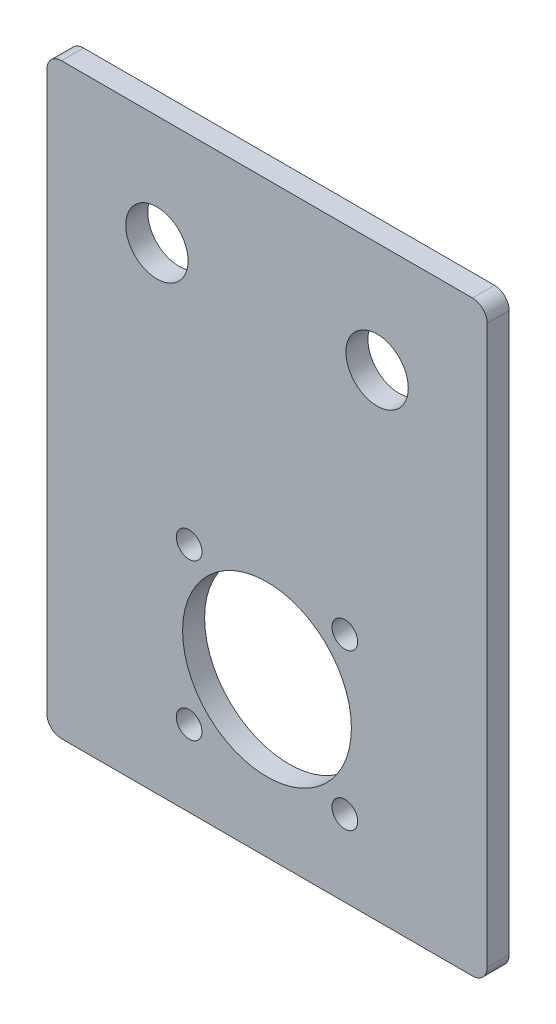
ISO-10303-21;
HEADER;
FILE_DESCRIPTION(('STEP AP214'),'2;1');
FILE_NAME('part.step','',(''),(''),'','','');
FILE_SCHEMA(('AUTOMOTIVE_DESIGN { 1 0 10303 214 1 1 1 1 }'));
ENDSEC;
DATA;
#1=APPLICATION_CONTEXT('core data for automotive mechanical design processes');
#2=APPLICATION_PROTOCOL_DEFINITION('international standard','automotive_design',2000,#1);
#3=PRODUCT_CONTEXT('',#1,'mechanical');
#4=PRODUCT('Part','Part','',(#3));
#5=PRODUCT_RELATED_PRODUCT_CATEGORY('part','',(#4));
#6=PRODUCT_DEFINITION_FORMATION('','',#4);
#7=PRODUCT_DEFINITION_CONTEXT('part definition',#1,'design');
#8=PRODUCT_DEFINITION('design','',#6,#7);
#9=PRODUCT_DEFINITION_SHAPE('','',#8);
#10=(LENGTH_UNIT() NAMED_UNIT(*) SI_UNIT(.MILLI.,.METRE.));
#11=(NAMED_UNIT(*) PLANE_ANGLE_UNIT() SI_UNIT($,.RADIAN.));
#12=(NAMED_UNIT(*) SI_UNIT($,.STERADIAN.) SOLID_ANGLE_UNIT());
#13=UNCERTAINTY_MEASURE_WITH_UNIT(LENGTH_MEASURE(1.E-05),#10,'distance_accuracy_value','');
#14=(GEOMETRIC_REPRESENTATION_CONTEXT(3) GLOBAL_UNCERTAINTY_ASSIGNED_CONTEXT((#13)) GLOBAL_UNIT_ASSIGNED_CONTEXT((#10,
#11,#12)) REPRESENTATION_CONTEXT('',''));
#15=CARTESIAN_POINT('',(0.,0.,0.));
#16=DIRECTION('',(0.,0.,1.));
#17=DIRECTION('',(1.,0.,0.));
#18=AXIS2_PLACEMENT_3D('',#15,#16,#17);
#19=CARTESIAN_POINT('',(0.,0.,3.));
#20=DIRECTION('',(1.,0.,0.));
#21=DIRECTION('',(0.,0.,-1.));
#22=AXIS2_PLACEMENT_3D('',#19,#20,#21);
#23=PLANE('',#22);
#24=DIRECTION('',(0.,-1.,0.));
#25=VECTOR('',#24,1.);
#26=CARTESIAN_POINT('',(0.,0.,3.));
#27=LINE('',#26,#25);
#28=CARTESIAN_POINT('',(0.,78.,3.));
#29=VERTEX_POINT('',#28);
#30=CARTESIAN_POINT('',(0.,2.,3.));
#31=VERTEX_POINT('',#30);
#32=EDGE_CURVE('E120',#29,#31,#27,.T.);
#33=ORIENTED_EDGE('',*,*,#32,.F.);
#34=DIRECTION('',(0.,0.,-1.));
#35=VECTOR('',#34,1.);
#36=CARTESIAN_POINT('',(0.,78.,3.));
#37=LINE('',#36,#35);
#38=CARTESIAN_POINT('',(0.,78.,0.));
#39=VERTEX_POINT('',#38);
#40=EDGE_CURVE('E105',#29,#39,#37,.T.);
#41=ORIENTED_EDGE('',*,*,#40,.T.);
#42=DIRECTION('',(0.,-1.,0.));
#43=VECTOR('',#42,1.);
#44=CARTESIAN_POINT('',(0.,0.,0.));
#45=LINE('',#44,#43);
#46=CARTESIAN_POINT('',(0.,2.,0.));
#47=VERTEX_POINT('',#46);
#48=EDGE_CURVE('E117',#39,#47,#45,.T.);
#49=ORIENTED_EDGE('',*,*,#48,.T.);
#50=DIRECTION('',(0.,0.,-1.));
#51=VECTOR('',#50,1.);
#52=CARTESIAN_POINT('',(0.,2.,3.));
#53=LINE('',#52,#51);
#54=EDGE_CURVE('E122',#47,#31,#53,.F.);
#55=ORIENTED_EDGE('',*,*,#54,.T.);
#56=EDGE_LOOP('',(#33,#41,#49,#55));
#57=FACE_BOUND('',#56,.T.);
#58=ADVANCED_FACE('F35',(#57),#23,.F.);
#59=CARTESIAN_POINT('',(0.,0.,3.));
#60=DIRECTION('',(0.,1.,0.));
#61=DIRECTION('',(0.,0.,1.));
#62=AXIS2_PLACEMENT_3D('',#59,#60,#61);
#63=PLANE('',#62);
#64=DIRECTION('',(1.,0.,0.));
#65=VECTOR('',#64,1.);
#66=CARTESIAN_POINT('',(0.,0.,0.));
#67=LINE('',#66,#65);
#68=CARTESIAN_POINT('',(2.,0.,0.));
#69=VERTEX_POINT('',#68);
#70=CARTESIAN_POINT('',(58.,0.,0.));
#71=VERTEX_POINT('',#70);
#72=EDGE_CURVE('E126',#69,#71,#67,.T.);
#73=ORIENTED_EDGE('',*,*,#72,.T.);
#74=DIRECTION('',(0.,0.,-1.));
#75=VECTOR('',#74,1.);
#76=CARTESIAN_POINT('',(58.,0.,3.));
#77=LINE('',#76,#75);
#78=CARTESIAN_POINT('',(58.,0.,3.));
#79=VERTEX_POINT('',#78);
#80=EDGE_CURVE('E11',#71,#79,#77,.F.);
#81=ORIENTED_EDGE('',*,*,#80,.T.);
#82=DIRECTION('',(1.,0.,0.));
#83=VECTOR('',#82,1.);
#84=CARTESIAN_POINT('',(0.,0.,3.));
#85=LINE('',#84,#83);
#86=CARTESIAN_POINT('',(2.,0.,3.));
#87=VERTEX_POINT('',#86);
#88=EDGE_CURVE('E166',#87,#79,#85,.T.);
#89=ORIENTED_EDGE('',*,*,#88,.F.);
#90=DIRECTION('',(0.,0.,-1.));
#91=VECTOR('',#90,1.);
#92=CARTESIAN_POINT('',(2.,0.,3.));
#93=LINE('',#92,#91);
#94=EDGE_CURVE('E43',#87,#69,#93,.T.);
#95=ORIENTED_EDGE('',*,*,#94,.T.);
#96=EDGE_LOOP('',(#73,#81,#89,#95));
#97=FACE_BOUND('',#96,.T.);
#98=ADVANCED_FACE('F164',(#97),#63,.F.);
#99=CARTESIAN_POINT('',(60.,0.,3.));
#100=DIRECTION('',(-1.,0.,0.));
#101=DIRECTION('',(0.,0.,1.));
#102=AXIS2_PLACEMENT_3D('',#99,#100,#101);
#103=PLANE('',#102);
#104=DIRECTION('',(0.,1.,0.));
#105=VECTOR('',#104,1.);
#106=CARTESIAN_POINT('',(60.,0.,0.));
#107=LINE('',#106,#105);
#108=CARTESIAN_POINT('',(60.,2.,0.));
#109=VERTEX_POINT('',#108);
#110=CARTESIAN_POINT('',(60.,78.,0.));
#111=VERTEX_POINT('',#110);
#112=EDGE_CURVE('E130',#109,#111,#107,.T.);
#113=ORIENTED_EDGE('',*,*,#112,.T.);
#114=DIRECTION('',(0.,0.,-1.));
#115=VECTOR('',#114,1.);
#116=CARTESIAN_POINT('',(60.,78.,3.));
#117=LINE('',#116,#115);
#118=CARTESIAN_POINT('',(60.,78.,3.));
#119=VERTEX_POINT('',#118);
#120=EDGE_CURVE('E50',#111,#119,#117,.F.);
#121=ORIENTED_EDGE('',*,*,#120,.T.);
#122=DIRECTION('',(0.,1.,0.));
#123=VECTOR('',#122,1.);
#124=CARTESIAN_POINT('',(60.,0.,3.));
#125=LINE('',#124,#123);
#126=CARTESIAN_POINT('',(60.,2.,3.));
#127=VERTEX_POINT('',#126);
#128=EDGE_CURVE('E174',#127,#119,#125,.T.);
#129=ORIENTED_EDGE('',*,*,#128,.F.);
#130=DIRECTION('',(0.,0.,-1.));
#131=VECTOR('',#130,1.);
#132=CARTESIAN_POINT('',(60.,2.,3.));
#133=LINE('',#132,#131);
#134=EDGE_CURVE('E157',#127,#109,#133,.T.);
#135=ORIENTED_EDGE('',*,*,#134,.T.);
#136=EDGE_LOOP('',(#113,#121,#129,#135));
#137=FACE_BOUND('',#136,.T.);
#138=ADVANCED_FACE('F173',(#137),#103,.F.);
#139=CARTESIAN_POINT('',(0.,80.,3.));
#140=DIRECTION('',(0.,-1.,0.));
#141=DIRECTION('',(0.,0.,-1.));
#142=AXIS2_PLACEMENT_3D('',#139,#140,#141);
#143=PLANE('',#142);
#144=DIRECTION('',(-1.,0.,0.));
#145=VECTOR('',#144,1.);
#146=CARTESIAN_POINT('',(0.,80.,0.));
#147=LINE('',#146,#145);
#148=CARTESIAN_POINT('',(58.,80.,0.));
#149=VERTEX_POINT('',#148);
#150=CARTESIAN_POINT('',(2.,80.,0.));
#151=VERTEX_POINT('',#150);
#152=EDGE_CURVE('E140',#149,#151,#147,.T.);
#153=ORIENTED_EDGE('',*,*,#152,.T.);
#154=DIRECTION('',(0.,0.,-1.));
#155=VECTOR('',#154,1.);
#156=CARTESIAN_POINT('',(2.,80.,3.));
#157=LINE('',#156,#155);
#158=CARTESIAN_POINT('',(2.,80.,3.));
#159=VERTEX_POINT('',#158);
#160=EDGE_CURVE('E106',#151,#159,#157,.F.);
#161=ORIENTED_EDGE('',*,*,#160,.T.);
#162=DIRECTION('',(-1.,0.,0.));
#163=VECTOR('',#162,1.);
#164=CARTESIAN_POINT('',(0.,80.,3.));
#165=LINE('',#164,#163);
#166=CARTESIAN_POINT('',(58.,80.,3.));
#167=VERTEX_POINT('',#166);
#168=EDGE_CURVE('E136',#167,#159,#165,.T.);
#169=ORIENTED_EDGE('',*,*,#168,.F.);
#170=DIRECTION('',(0.,0.,-1.));
#171=VECTOR('',#170,1.);
#172=CARTESIAN_POINT('',(58.,80.,3.));
#173=LINE('',#172,#171);
#174=EDGE_CURVE('E111',#167,#149,#173,.T.);
#175=ORIENTED_EDGE('',*,*,#174,.T.);
#176=EDGE_LOOP('',(#153,#161,#169,#175));
#177=FACE_BOUND('',#176,.T.);
#178=ADVANCED_FACE('F232',(#177),#143,.F.);
#179=CARTESIAN_POINT('',(0.,0.,3.));
#180=DIRECTION('',(0.,0.,-1.));
#181=DIRECTION('',(-1.,0.,0.));
#182=AXIS2_PLACEMENT_3D('',#179,#180,#181);
#183=PLANE('',#182);
#184=CARTESIAN_POINT('',(40.6066017177989,10.3933982822025,3.));
#185=DIRECTION('',(0.,0.,1.));
#186=DIRECTION('',(1.,0.,0.));
#187=AXIS2_PLACEMENT_3D('',#184,#185,#186);
#188=CIRCLE('',#187,1.75);
#189=CARTESIAN_POINT('',(42.3566017177989,10.3933982822025,3.));
#190=VERTEX_POINT('',#189);
#191=EDGE_CURVE('E201',#190,#190,#188,.T.);
#192=ORIENTED_EDGE('',*,*,#191,.F.);
#193=EDGE_LOOP('',(#192));
#194=FACE_BOUND('',#193,.T.);
#195=CARTESIAN_POINT('',(19.3933982822025,10.3933982822018,3.));
#196=DIRECTION('',(0.,0.,1.));
#197=DIRECTION('',(1.,0.,0.));
#198=AXIS2_PLACEMENT_3D('',#195,#196,#197);
#199=CIRCLE('',#198,1.75);
#200=CARTESIAN_POINT('',(21.1433982822025,10.3933982822018,3.));
#201=VERTEX_POINT('',#200);
#202=EDGE_CURVE('E213',#201,#201,#199,.T.);
#203=ORIENTED_EDGE('',*,*,#202,.F.);
#204=EDGE_LOOP('',(#203));
#205=FACE_BOUND('',#204,.T.);
#206=CARTESIAN_POINT('',(45.,65.,3.));
#207=DIRECTION('',(0.,0.,1.));
#208=DIRECTION('',(1.,0.,0.));
#209=AXIS2_PLACEMENT_3D('',#206,#207,#208);
#210=CIRCLE('',#209,4.25000000000001);
#211=CARTESIAN_POINT('',(49.25,65.,3.));
#212=VERTEX_POINT('',#211);
#213=EDGE_CURVE('E207',#212,#212,#210,.T.);
#214=ORIENTED_EDGE('',*,*,#213,.F.);
#215=EDGE_LOOP('',(#214));
#216=FACE_BOUND('',#215,.T.);
#217=CARTESIAN_POINT('',(19.3933982822018,31.6066017177982,3.));
#218=DIRECTION('',(0.,0.,1.));
#219=DIRECTION('',(1.,0.,0.));
#220=AXIS2_PLACEMENT_3D('',#217,#218,#219);
#221=CIRCLE('',#220,1.75);
#222=CARTESIAN_POINT('',(21.1433982822018,31.6066017177982,3.));
#223=VERTEX_POINT('',#222);
#224=EDGE_CURVE('E183',#223,#223,#221,.T.);
#225=ORIENTED_EDGE('',*,*,#224,.F.);
#226=EDGE_LOOP('',(#225));
#227=FACE_BOUND('',#226,.T.);
#228=CARTESIAN_POINT('',(15.,65.,3.));
#229=DIRECTION('',(0.,0.,1.));
#230=DIRECTION('',(1.,0.,0.));
#231=AXIS2_PLACEMENT_3D('',#228,#229,#230);
#232=CIRCLE('',#231,4.25);
#233=CARTESIAN_POINT('',(19.25,65.,3.));
#234=VERTEX_POINT('',#233);
#235=EDGE_CURVE('E196',#234,#234,#232,.T.);
#236=ORIENTED_EDGE('',*,*,#235,.F.);
#237=EDGE_LOOP('',(#236));
#238=FACE_BOUND('',#237,.T.);
#239=CARTESIAN_POINT('',(40.6066017177982,31.6066017177989,3.));
#240=DIRECTION('',(0.,0.,1.));
#241=DIRECTION('',(1.,0.,0.));
#242=AXIS2_PLACEMENT_3D('',#239,#240,#241);
#243=CIRCLE('',#242,1.75);
#244=CARTESIAN_POINT('',(42.3566017177982,31.6066017177989,3.));
#245=VERTEX_POINT('',#244);
#246=EDGE_CURVE('E189',#245,#245,#243,.T.);
#247=ORIENTED_EDGE('',*,*,#246,.F.);
#248=EDGE_LOOP('',(#247));
#249=FACE_BOUND('',#248,.T.);
#250=CARTESIAN_POINT('',(30.,21.,3.));
#251=DIRECTION('',(0.,0.,1.));
#252=DIRECTION('',(1.,0.,0.));
#253=AXIS2_PLACEMENT_3D('',#250,#251,#252);
#254=CIRCLE('',#253,11.5);
#255=CARTESIAN_POINT('',(41.5,21.,3.));
#256=VERTEX_POINT('',#255);
#257=EDGE_CURVE('E133',#256,#256,#254,.T.);
#258=ORIENTED_EDGE('',*,*,#257,.F.);
#259=EDGE_LOOP('',(#258));
#260=FACE_BOUND('',#259,.T.);
#261=ORIENTED_EDGE('',*,*,#168,.T.);
#262=CARTESIAN_POINT('',(2.,78.,3.));
#263=DIRECTION('',(0.,0.,-1.));
#264=DIRECTION('',(-1.,0.,0.));
#265=AXIS2_PLACEMENT_3D('',#262,#263,#264);
#266=CIRCLE('',#265,2.);
#267=EDGE_CURVE('E155',#159,#29,#266,.F.);
#268=ORIENTED_EDGE('',*,*,#267,.T.);
#269=ORIENTED_EDGE('',*,*,#32,.T.);
#270=CARTESIAN_POINT('',(2.,2.,3.));
#271=DIRECTION('',(0.,0.,-1.));
#272=DIRECTION('',(-1.,0.,0.));
#273=AXIS2_PLACEMENT_3D('',#270,#271,#272);
#274=CIRCLE('',#273,2.);
#275=EDGE_CURVE('E150',#31,#87,#274,.F.);
#276=ORIENTED_EDGE('',*,*,#275,.T.);
#277=ORIENTED_EDGE('',*,*,#88,.T.);
#278=CARTESIAN_POINT('',(58.,2.,3.));
#279=DIRECTION('',(0.,0.,-1.));
#280=DIRECTION('',(-1.,0.,0.));
#281=AXIS2_PLACEMENT_3D('',#278,#279,#280);
#282=CIRCLE('',#281,2.);
#283=EDGE_CURVE('E57',#79,#127,#282,.F.);
#284=ORIENTED_EDGE('',*,*,#283,.T.);
#285=ORIENTED_EDGE('',*,*,#128,.T.);
#286=CARTESIAN_POINT('',(58.,78.,3.));
#287=DIRECTION('',(0.,0.,-1.));
#288=DIRECTION('',(-1.,0.,0.));
#289=AXIS2_PLACEMENT_3D('',#286,#287,#288);
#290=CIRCLE('',#289,2.);
#291=EDGE_CURVE('E153',#119,#167,#290,.F.);
#292=ORIENTED_EDGE('',*,*,#291,.T.);
#293=EDGE_LOOP('',(#261,#268,#269,#276,#277,#284,#285,#292));
#294=FACE_BOUND('',#293,.T.);
#295=ADVANCED_FACE('F229',(#194,#205,#216,#227,#238,#249,#260,#294),#183,.F.);
#296=CARTESIAN_POINT('',(0.,0.,0.));
#297=DIRECTION('',(0.,0.,-1.));
#298=DIRECTION('',(-1.,0.,0.));
#299=AXIS2_PLACEMENT_3D('',#296,#297,#298);
#300=PLANE('',#299);
#301=CARTESIAN_POINT('',(40.6066017177989,10.3933982822025,0.));
#302=DIRECTION('',(0.,0.,1.));
#303=DIRECTION('',(1.,0.,0.));
#304=AXIS2_PLACEMENT_3D('',#301,#302,#303);
#305=CIRCLE('',#304,1.75);
#306=CARTESIAN_POINT('',(42.3566017177989,10.3933982822025,0.));
#307=VERTEX_POINT('',#306);
#308=EDGE_CURVE('E193',#307,#307,#305,.T.);
#309=ORIENTED_EDGE('',*,*,#308,.T.);
#310=EDGE_LOOP('',(#309));
#311=FACE_BOUND('',#310,.T.);
#312=CARTESIAN_POINT('',(19.3933982822025,10.3933982822018,0.));
#313=DIRECTION('',(0.,0.,1.));
#314=DIRECTION('',(1.,0.,0.));
#315=AXIS2_PLACEMENT_3D('',#312,#313,#314);
#316=CIRCLE('',#315,1.75);
#317=CARTESIAN_POINT('',(21.1433982822025,10.3933982822018,0.));
#318=VERTEX_POINT('',#317);
#319=EDGE_CURVE('E204',#318,#318,#316,.T.);
#320=ORIENTED_EDGE('',*,*,#319,.T.);
#321=EDGE_LOOP('',(#320));
#322=FACE_BOUND('',#321,.T.);
#323=CARTESIAN_POINT('',(45.,65.,0.));
#324=DIRECTION('',(0.,0.,1.));
#325=DIRECTION('',(1.,0.,0.));
#326=AXIS2_PLACEMENT_3D('',#323,#324,#325);
#327=CIRCLE('',#326,4.25000000000001);
#328=CARTESIAN_POINT('',(49.25,65.,0.));
#329=VERTEX_POINT('',#328);
#330=EDGE_CURVE('E210',#329,#329,#327,.T.);
#331=ORIENTED_EDGE('',*,*,#330,.T.);
#332=EDGE_LOOP('',(#331));
#333=FACE_BOUND('',#332,.T.);
#334=CARTESIAN_POINT('',(19.3933982822018,31.6066017177982,0.));
#335=DIRECTION('',(0.,0.,1.));
#336=DIRECTION('',(1.,0.,0.));
#337=AXIS2_PLACEMENT_3D('',#334,#335,#336);
#338=CIRCLE('',#337,1.75);
#339=CARTESIAN_POINT('',(21.1433982822018,31.6066017177982,0.));
#340=VERTEX_POINT('',#339);
#341=EDGE_CURVE('E181',#340,#340,#338,.T.);
#342=ORIENTED_EDGE('',*,*,#341,.T.);
#343=EDGE_LOOP('',(#342));
#344=FACE_BOUND('',#343,.T.);
#345=CARTESIAN_POINT('',(15.,65.,0.));
#346=DIRECTION('',(0.,0.,1.));
#347=DIRECTION('',(1.,0.,0.));
#348=AXIS2_PLACEMENT_3D('',#345,#346,#347);
#349=CIRCLE('',#348,4.25);
#350=CARTESIAN_POINT('',(19.25,65.,0.));
#351=VERTEX_POINT('',#350);
#352=EDGE_CURVE('E186',#351,#351,#349,.T.);
#353=ORIENTED_EDGE('',*,*,#352,.T.);
#354=EDGE_LOOP('',(#353));
#355=FACE_BOUND('',#354,.T.);
#356=CARTESIAN_POINT('',(40.6066017177982,31.6066017177989,0.));
#357=DIRECTION('',(0.,0.,1.));
#358=DIRECTION('',(1.,0.,0.));
#359=AXIS2_PLACEMENT_3D('',#356,#357,#358);
#360=CIRCLE('',#359,1.75);
#361=CARTESIAN_POINT('',(42.3566017177982,31.6066017177989,0.));
#362=VERTEX_POINT('',#361);
#363=EDGE_CURVE('E192',#362,#362,#360,.T.);
#364=ORIENTED_EDGE('',*,*,#363,.T.);
#365=EDGE_LOOP('',(#364));
#366=FACE_BOUND('',#365,.T.);
#367=CARTESIAN_POINT('',(30.,21.,0.));
#368=DIRECTION('',(0.,0.,1.));
#369=DIRECTION('',(1.,0.,0.));
#370=AXIS2_PLACEMENT_3D('',#367,#368,#369);
#371=CIRCLE('',#370,11.5);
#372=CARTESIAN_POINT('',(41.5,21.,0.));
#373=VERTEX_POINT('',#372);
#374=EDGE_CURVE('E127',#373,#373,#371,.T.);
#375=ORIENTED_EDGE('',*,*,#374,.T.);
#376=EDGE_LOOP('',(#375));
#377=FACE_BOUND('',#376,.T.);
#378=ORIENTED_EDGE('',*,*,#48,.F.);
#379=CARTESIAN_POINT('',(2.,78.,0.));
#380=DIRECTION('',(0.,0.,-1.));
#381=DIRECTION('',(-1.,0.,0.));
#382=AXIS2_PLACEMENT_3D('',#379,#380,#381);
#383=CIRCLE('',#382,2.);
#384=EDGE_CURVE('E101',#39,#151,#383,.T.);
#385=ORIENTED_EDGE('',*,*,#384,.T.);
#386=ORIENTED_EDGE('',*,*,#152,.F.);
#387=CARTESIAN_POINT('',(58.,78.,0.));
#388=DIRECTION('',(0.,0.,-1.));
#389=DIRECTION('',(-1.,0.,0.));
#390=AXIS2_PLACEMENT_3D('',#387,#388,#389);
#391=CIRCLE('',#390,2.);
#392=EDGE_CURVE('E112',#149,#111,#391,.T.);
#393=ORIENTED_EDGE('',*,*,#392,.T.);
#394=ORIENTED_EDGE('',*,*,#112,.F.);
#395=CARTESIAN_POINT('',(58.,2.,0.));
#396=DIRECTION('',(0.,0.,-1.));
#397=DIRECTION('',(-1.,0.,0.));
#398=AXIS2_PLACEMENT_3D('',#395,#396,#397);
#399=CIRCLE('',#398,2.);
#400=EDGE_CURVE('E144',#109,#71,#399,.T.);
#401=ORIENTED_EDGE('',*,*,#400,.T.);
#402=ORIENTED_EDGE('',*,*,#72,.F.);
#403=CARTESIAN_POINT('',(2.,2.,0.));
#404=DIRECTION('',(0.,0.,-1.));
#405=DIRECTION('',(-1.,0.,0.));
#406=AXIS2_PLACEMENT_3D('',#403,#404,#405);
#407=CIRCLE('',#406,2.);
#408=EDGE_CURVE('E121',#69,#47,#407,.T.);
#409=ORIENTED_EDGE('',*,*,#408,.T.);
#410=EDGE_LOOP('',(#378,#385,#386,#393,#394,#401,#402,#409));
#411=FACE_BOUND('',#410,.T.);
#412=ADVANCED_FACE('F124',(#311,#322,#333,#344,#355,#366,#377,#411),#300,.T.);
#413=CARTESIAN_POINT('',(30.,21.,0.));
#414=DIRECTION('',(0.,0.,1.));
#415=DIRECTION('',(1.,0.,0.));
#416=AXIS2_PLACEMENT_3D('',#413,#414,#415);
#417=CYLINDRICAL_SURFACE('',#416,11.5);
#418=ORIENTED_EDGE('',*,*,#374,.F.);
#419=EDGE_LOOP('',(#418));
#420=FACE_BOUND('',#419,.T.);
#421=ORIENTED_EDGE('',*,*,#257,.T.);
#422=EDGE_LOOP('',(#421));
#423=FACE_BOUND('',#422,.T.);
#424=ADVANCED_FACE('F268',(#420,#423),#417,.F.);
#425=CARTESIAN_POINT('',(40.6066017177982,31.6066017177989,0.));
#426=DIRECTION('',(0.,0.,1.));
#427=DIRECTION('',(1.,0.,0.));
#428=AXIS2_PLACEMENT_3D('',#425,#426,#427);
#429=CYLINDRICAL_SURFACE('',#428,1.75);
#430=ORIENTED_EDGE('',*,*,#363,.F.);
#431=EDGE_LOOP('',(#430));
#432=FACE_BOUND('',#431,.T.);
#433=ORIENTED_EDGE('',*,*,#246,.T.);
#434=EDGE_LOOP('',(#433));
#435=FACE_BOUND('',#434,.T.);
#436=ADVANCED_FACE('F273',(#432,#435),#429,.F.);
#437=CARTESIAN_POINT('',(15.,65.,0.));
#438=DIRECTION('',(0.,0.,1.));
#439=DIRECTION('',(1.,0.,0.));
#440=AXIS2_PLACEMENT_3D('',#437,#438,#439);
#441=CYLINDRICAL_SURFACE('',#440,4.25);
#442=ORIENTED_EDGE('',*,*,#352,.F.);
#443=EDGE_LOOP('',(#442));
#444=FACE_BOUND('',#443,.T.);
#445=ORIENTED_EDGE('',*,*,#235,.T.);
#446=EDGE_LOOP('',(#445));
#447=FACE_BOUND('',#446,.T.);
#448=ADVANCED_FACE('F278',(#444,#447),#441,.F.);
#449=CARTESIAN_POINT('',(19.3933982822018,31.6066017177982,0.));
#450=DIRECTION('',(0.,0.,1.));
#451=DIRECTION('',(1.,0.,0.));
#452=AXIS2_PLACEMENT_3D('',#449,#450,#451);
#453=CYLINDRICAL_SURFACE('',#452,1.75);
#454=ORIENTED_EDGE('',*,*,#341,.F.);
#455=EDGE_LOOP('',(#454));
#456=FACE_BOUND('',#455,.T.);
#457=ORIENTED_EDGE('',*,*,#224,.T.);
#458=EDGE_LOOP('',(#457));
#459=FACE_BOUND('',#458,.T.);
#460=ADVANCED_FACE('F275',(#456,#459),#453,.F.);
#461=CARTESIAN_POINT('',(45.,65.,0.));
#462=DIRECTION('',(0.,0.,1.));
#463=DIRECTION('',(1.,0.,0.));
#464=AXIS2_PLACEMENT_3D('',#461,#462,#463);
#465=CYLINDRICAL_SURFACE('',#464,4.25000000000001);
#466=ORIENTED_EDGE('',*,*,#330,.F.);
#467=EDGE_LOOP('',(#466));
#468=FACE_BOUND('',#467,.T.);
#469=ORIENTED_EDGE('',*,*,#213,.T.);
#470=EDGE_LOOP('',(#469));
#471=FACE_BOUND('',#470,.T.);
#472=ADVANCED_FACE('F225',(#468,#471),#465,.F.);
#473=CARTESIAN_POINT('',(19.3933982822025,10.3933982822018,0.));
#474=DIRECTION('',(0.,0.,1.));
#475=DIRECTION('',(1.,0.,0.));
#476=AXIS2_PLACEMENT_3D('',#473,#474,#475);
#477=CYLINDRICAL_SURFACE('',#476,1.75);
#478=ORIENTED_EDGE('',*,*,#319,.F.);
#479=EDGE_LOOP('',(#478));
#480=FACE_BOUND('',#479,.T.);
#481=ORIENTED_EDGE('',*,*,#202,.T.);
#482=EDGE_LOOP('',(#481));
#483=FACE_BOUND('',#482,.T.);
#484=ADVANCED_FACE('F221',(#480,#483),#477,.F.);
#485=CARTESIAN_POINT('',(40.6066017177989,10.3933982822025,0.));
#486=DIRECTION('',(0.,0.,1.));
#487=DIRECTION('',(1.,0.,0.));
#488=AXIS2_PLACEMENT_3D('',#485,#486,#487);
#489=CYLINDRICAL_SURFACE('',#488,1.75);
#490=ORIENTED_EDGE('',*,*,#308,.F.);
#491=EDGE_LOOP('',(#490));
#492=FACE_BOUND('',#491,.T.);
#493=ORIENTED_EDGE('',*,*,#191,.T.);
#494=EDGE_LOOP('',(#493));
#495=FACE_BOUND('',#494,.T.);
#496=ADVANCED_FACE('F224',(#492,#495),#489,.F.);
#497=CARTESIAN_POINT('',(2.,78.,3.));
#498=DIRECTION('',(0.,0.,-1.));
#499=DIRECTION('',(-1.,0.,0.));
#500=AXIS2_PLACEMENT_3D('',#497,#498,#499);
#501=CYLINDRICAL_SURFACE('',#500,2.);
#502=ORIENTED_EDGE('',*,*,#267,.F.);
#503=ORIENTED_EDGE('',*,*,#160,.F.);
#504=ORIENTED_EDGE('',*,*,#384,.F.);
#505=ORIENTED_EDGE('',*,*,#40,.F.);
#506=EDGE_LOOP('',(#502,#503,#504,#505));
#507=FACE_BOUND('',#506,.T.);
#508=ADVANCED_FACE('F104',(#507),#501,.T.);
#509=CARTESIAN_POINT('',(58.,78.,3.));
#510=DIRECTION('',(0.,0.,-1.));
#511=DIRECTION('',(-1.,0.,0.));
#512=AXIS2_PLACEMENT_3D('',#509,#510,#511);
#513=CYLINDRICAL_SURFACE('',#512,2.);
#514=ORIENTED_EDGE('',*,*,#291,.F.);
#515=ORIENTED_EDGE('',*,*,#120,.F.);
#516=ORIENTED_EDGE('',*,*,#392,.F.);
#517=ORIENTED_EDGE('',*,*,#174,.F.);
#518=EDGE_LOOP('',(#514,#515,#516,#517));
#519=FACE_BOUND('',#518,.T.);
#520=ADVANCED_FACE('F248',(#519),#513,.T.);
#521=CARTESIAN_POINT('',(58.,2.,3.));
#522=DIRECTION('',(0.,0.,-1.));
#523=DIRECTION('',(-1.,0.,0.));
#524=AXIS2_PLACEMENT_3D('',#521,#522,#523);
#525=CYLINDRICAL_SURFACE('',#524,2.);
#526=ORIENTED_EDGE('',*,*,#283,.F.);
#527=ORIENTED_EDGE('',*,*,#80,.F.);
#528=ORIENTED_EDGE('',*,*,#400,.F.);
#529=ORIENTED_EDGE('',*,*,#134,.F.);
#530=EDGE_LOOP('',(#526,#527,#528,#529));
#531=FACE_BOUND('',#530,.T.);
#532=ADVANCED_FACE('F172',(#531),#525,.T.);
#533=CARTESIAN_POINT('',(2.,2.,3.));
#534=DIRECTION('',(0.,0.,-1.));
#535=DIRECTION('',(-1.,0.,0.));
#536=AXIS2_PLACEMENT_3D('',#533,#534,#535);
#537=CYLINDRICAL_SURFACE('',#536,2.);
#538=ORIENTED_EDGE('',*,*,#275,.F.);
#539=ORIENTED_EDGE('',*,*,#54,.F.);
#540=ORIENTED_EDGE('',*,*,#408,.F.);
#541=ORIENTED_EDGE('',*,*,#94,.F.);
#542=EDGE_LOOP('',(#538,#539,#540,#541));
#543=FACE_BOUND('',#542,.T.);
#544=ADVANCED_FACE('F37',(#543),#537,.T.);
#545=CLOSED_SHELL('',(#58,#98,#138,#178,#295,#412,#424,#436,#448,#460,#472,#484,#496,#508,#520,
#532,#544));
#546=MANIFOLD_SOLID_BREP('B2',#545);
#547=ADVANCED_BREP_SHAPE_REPRESENTATION('',(#18,#546),#14);
#548=SHAPE_DEFINITION_REPRESENTATION(#9,#547);
ENDSEC;
END-ISO-10303-21;
